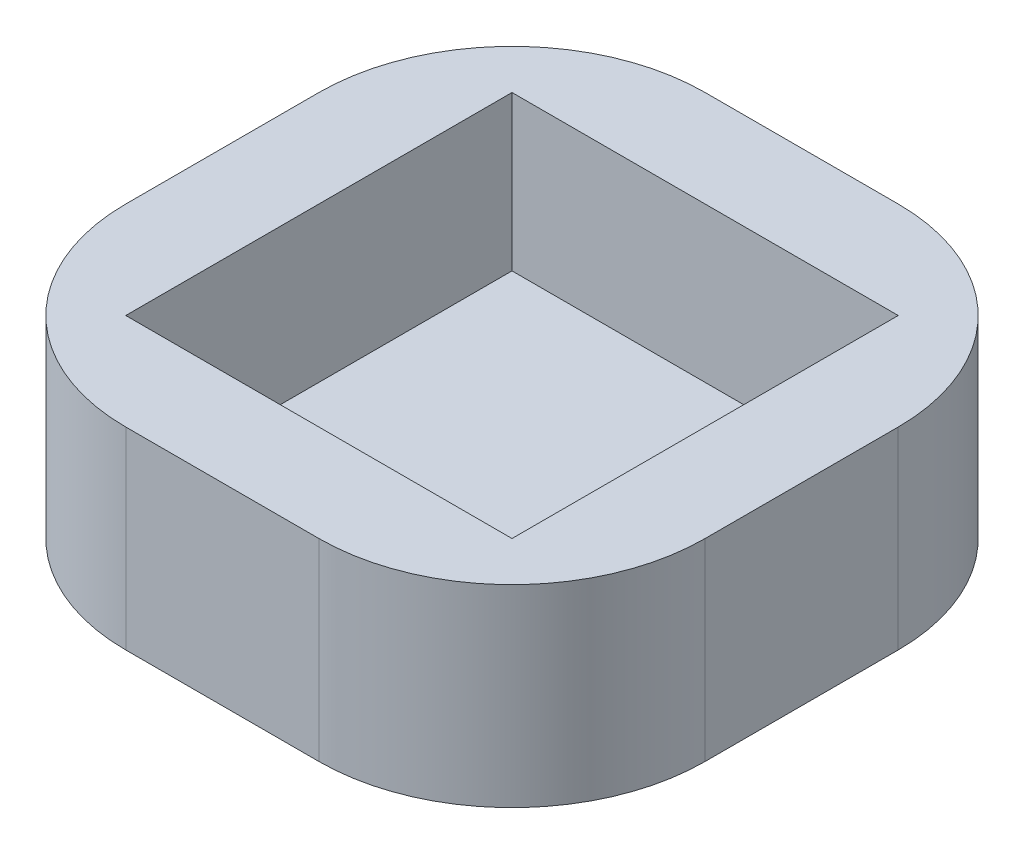
ISO-10303-21;
HEADER;
FILE_DESCRIPTION(('STEP AP214'),'2;1');
FILE_NAME('part.step','',(''),(''),'','','');
FILE_SCHEMA(('AUTOMOTIVE_DESIGN { 1 0 10303 214 1 1 1 1 }'));
ENDSEC;
DATA;
#1=APPLICATION_CONTEXT('core data for automotive mechanical design processes');
#2=APPLICATION_PROTOCOL_DEFINITION('international standard','automotive_design',2000,#1);
#3=PRODUCT_CONTEXT('',#1,'mechanical');
#4=PRODUCT('Part','Part','',(#3));
#5=PRODUCT_RELATED_PRODUCT_CATEGORY('part','',(#4));
#6=PRODUCT_DEFINITION_FORMATION('','',#4);
#7=PRODUCT_DEFINITION_CONTEXT('part definition',#1,'design');
#8=PRODUCT_DEFINITION('design','',#6,#7);
#9=PRODUCT_DEFINITION_SHAPE('','',#8);
#10=(LENGTH_UNIT() NAMED_UNIT(*) SI_UNIT(.MILLI.,.METRE.));
#11=(NAMED_UNIT(*) PLANE_ANGLE_UNIT() SI_UNIT($,.RADIAN.));
#12=(NAMED_UNIT(*) SI_UNIT($,.STERADIAN.) SOLID_ANGLE_UNIT());
#13=UNCERTAINTY_MEASURE_WITH_UNIT(LENGTH_MEASURE(1.E-05),#10,'distance_accuracy_value','');
#14=(GEOMETRIC_REPRESENTATION_CONTEXT(3) GLOBAL_UNCERTAINTY_ASSIGNED_CONTEXT((#13)) GLOBAL_UNIT_ASSIGNED_CONTEXT((#10,
#11,#12)) REPRESENTATION_CONTEXT('',''));
#15=CARTESIAN_POINT('',(0.,0.,0.));
#16=DIRECTION('',(0.,0.,1.));
#17=DIRECTION('',(1.,0.,0.));
#18=AXIS2_PLACEMENT_3D('',#15,#16,#17);
#19=CARTESIAN_POINT('',(-26.3921045150164,10.,10.6494234146817));
#20=DIRECTION('',(0.,-1.,0.));
#21=DIRECTION('',(0.,0.,-1.));
#22=AXIS2_PLACEMENT_3D('',#19,#20,#21);
#23=CYLINDRICAL_SURFACE('',#22,10.);
#24=CARTESIAN_POINT('',(-26.3921045150164,0.,10.6494234146817));
#25=DIRECTION('',(0.,1.,0.));
#26=DIRECTION('',(0.,0.,1.));
#27=AXIS2_PLACEMENT_3D('',#24,#25,#26);
#28=CIRCLE('',#27,10.);
#29=CARTESIAN_POINT('',(-36.3921045150164,0.,10.6494234146816));
#30=VERTEX_POINT('',#29);
#31=CARTESIAN_POINT('',(-26.3921045150163,0.,20.6494234146817));
#32=VERTEX_POINT('',#31);
#33=EDGE_CURVE('E141',#30,#32,#28,.T.);
#34=ORIENTED_EDGE('',*,*,#33,.T.);
#35=DIRECTION('',(0.,-1.,0.));
#36=VECTOR('',#35,1.);
#37=CARTESIAN_POINT('',(-26.3921045150163,10.,20.6494234146817));
#38=LINE('',#37,#36);
#39=CARTESIAN_POINT('',(-26.3921045150163,10.,20.6494234146817));
#40=VERTEX_POINT('',#39);
#41=EDGE_CURVE('E11',#40,#32,#38,.T.);
#42=ORIENTED_EDGE('',*,*,#41,.F.);
#43=CARTESIAN_POINT('',(-26.3921045150164,10.,10.6494234146817));
#44=DIRECTION('',(0.,1.,0.));
#45=DIRECTION('',(0.,0.,1.));
#46=AXIS2_PLACEMENT_3D('',#43,#44,#45);
#47=CIRCLE('',#46,10.);
#48=CARTESIAN_POINT('',(-36.3921045150164,10.,10.6494234146816));
#49=VERTEX_POINT('',#48);
#50=EDGE_CURVE('E157',#49,#40,#47,.T.);
#51=ORIENTED_EDGE('',*,*,#50,.F.);
#52=DIRECTION('',(0.,-1.,0.));
#53=VECTOR('',#52,1.);
#54=CARTESIAN_POINT('',(-36.3921045150164,10.,10.6494234146816));
#55=LINE('',#54,#53);
#56=EDGE_CURVE('E137',#49,#30,#55,.T.);
#57=ORIENTED_EDGE('',*,*,#56,.T.);
#58=EDGE_LOOP('',(#34,#42,#51,#57));
#59=FACE_BOUND('',#58,.T.);
#60=ADVANCED_FACE('F33',(#59),#23,.T.);
#61=CARTESIAN_POINT('',(-26.3921045150163,10.,20.6494234146817));
#62=DIRECTION('',(0.,0.,-1.));
#63=DIRECTION('',(-1.,0.,0.));
#64=AXIS2_PLACEMENT_3D('',#61,#62,#63);
#65=PLANE('',#64);
#66=DIRECTION('',(1.,0.,0.));
#67=VECTOR('',#66,1.);
#68=CARTESIAN_POINT('',(-26.3921045150163,0.,20.6494234146817));
#69=LINE('',#68,#67);
#70=CARTESIAN_POINT('',(-16.3921045150164,0.,20.6494234146817));
#71=VERTEX_POINT('',#70);
#72=EDGE_CURVE('E144',#32,#71,#69,.T.);
#73=ORIENTED_EDGE('',*,*,#72,.T.);
#74=DIRECTION('',(0.,-1.,0.));
#75=VECTOR('',#74,1.);
#76=CARTESIAN_POINT('',(-16.3921045150164,10.,20.6494234146817));
#77=LINE('',#76,#75);
#78=CARTESIAN_POINT('',(-16.3921045150164,10.,20.6494234146817));
#79=VERTEX_POINT('',#78);
#80=EDGE_CURVE('E40',#79,#71,#77,.T.);
#81=ORIENTED_EDGE('',*,*,#80,.F.);
#82=DIRECTION('',(1.,0.,0.));
#83=VECTOR('',#82,1.);
#84=CARTESIAN_POINT('',(-26.3921045150163,10.,20.6494234146817));
#85=LINE('',#84,#83);
#86=EDGE_CURVE('E97',#40,#79,#85,.T.);
#87=ORIENTED_EDGE('',*,*,#86,.F.);
#88=ORIENTED_EDGE('',*,*,#41,.T.);
#89=EDGE_LOOP('',(#73,#81,#87,#88));
#90=FACE_BOUND('',#89,.T.);
#91=ADVANCED_FACE('F260',(#90),#65,.F.);
#92=CARTESIAN_POINT('',(-16.3921045150164,10.,10.6494234146817));
#93=DIRECTION('',(0.,-1.,0.));
#94=DIRECTION('',(0.,0.,-1.));
#95=AXIS2_PLACEMENT_3D('',#92,#93,#94);
#96=CYLINDRICAL_SURFACE('',#95,10.);
#97=CARTESIAN_POINT('',(-16.3921045150164,0.,10.6494234146817));
#98=DIRECTION('',(0.,1.,0.));
#99=DIRECTION('',(0.,0.,1.));
#100=AXIS2_PLACEMENT_3D('',#97,#98,#99);
#101=CIRCLE('',#100,10.);
#102=CARTESIAN_POINT('',(-6.3921045150164,0.,10.6494234146817));
#103=VERTEX_POINT('',#102);
#104=EDGE_CURVE('E147',#71,#103,#101,.T.);
#105=ORIENTED_EDGE('',*,*,#104,.T.);
#106=DIRECTION('',(0.,-1.,0.));
#107=VECTOR('',#106,1.);
#108=CARTESIAN_POINT('',(-6.3921045150164,10.,10.6494234146817));
#109=LINE('',#108,#107);
#110=CARTESIAN_POINT('',(-6.3921045150164,10.,10.6494234146817));
#111=VERTEX_POINT('',#110);
#112=EDGE_CURVE('E164',#111,#103,#109,.T.);
#113=ORIENTED_EDGE('',*,*,#112,.F.);
#114=CARTESIAN_POINT('',(-16.3921045150164,10.,10.6494234146817));
#115=DIRECTION('',(0.,1.,0.));
#116=DIRECTION('',(0.,0.,1.));
#117=AXIS2_PLACEMENT_3D('',#114,#115,#116);
#118=CIRCLE('',#117,10.);
#119=EDGE_CURVE('E172',#79,#111,#118,.T.);
#120=ORIENTED_EDGE('',*,*,#119,.F.);
#121=ORIENTED_EDGE('',*,*,#80,.T.);
#122=EDGE_LOOP('',(#105,#113,#120,#121));
#123=FACE_BOUND('',#122,.T.);
#124=ADVANCED_FACE('F170',(#123),#96,.T.);
#125=CARTESIAN_POINT('',(-6.3921045150164,10.,0.649423414681678));
#126=DIRECTION('',(-1.,0.,0.));
#127=DIRECTION('',(0.,0.,1.));
#128=AXIS2_PLACEMENT_3D('',#125,#126,#127);
#129=PLANE('',#128);
#130=DIRECTION('',(0.,0.,-1.));
#131=VECTOR('',#130,1.);
#132=CARTESIAN_POINT('',(-6.3921045150164,0.,0.649423414681678));
#133=LINE('',#132,#131);
#134=CARTESIAN_POINT('',(-6.3921045150164,0.,0.649423414681679));
#135=VERTEX_POINT('',#134);
#136=EDGE_CURVE('E149',#103,#135,#133,.T.);
#137=ORIENTED_EDGE('',*,*,#136,.T.);
#138=DIRECTION('',(0.,-1.,0.));
#139=VECTOR('',#138,1.);
#140=CARTESIAN_POINT('',(-6.3921045150164,10.,0.649423414681679));
#141=LINE('',#140,#139);
#142=CARTESIAN_POINT('',(-6.3921045150164,10.,0.649423414681679));
#143=VERTEX_POINT('',#142);
#144=EDGE_CURVE('E161',#143,#135,#141,.T.);
#145=ORIENTED_EDGE('',*,*,#144,.F.);
#146=DIRECTION('',(0.,0.,-1.));
#147=VECTOR('',#146,1.);
#148=CARTESIAN_POINT('',(-6.3921045150164,10.,0.649423414681678));
#149=LINE('',#148,#147);
#150=EDGE_CURVE('E184',#111,#143,#149,.T.);
#151=ORIENTED_EDGE('',*,*,#150,.F.);
#152=ORIENTED_EDGE('',*,*,#112,.T.);
#153=EDGE_LOOP('',(#137,#145,#151,#152));
#154=FACE_BOUND('',#153,.T.);
#155=ADVANCED_FACE('F180',(#154),#129,.F.);
#156=CARTESIAN_POINT('',(-16.3921045150164,10.,0.649423414681679));
#157=DIRECTION('',(0.,-1.,0.));
#158=DIRECTION('',(0.,0.,-1.));
#159=AXIS2_PLACEMENT_3D('',#156,#157,#158);
#160=CYLINDRICAL_SURFACE('',#159,10.);
#161=CARTESIAN_POINT('',(-16.3921045150164,0.,0.649423414681679));
#162=DIRECTION('',(0.,1.,0.));
#163=DIRECTION('',(0.,0.,-1.));
#164=AXIS2_PLACEMENT_3D('',#161,#162,#163);
#165=CIRCLE('',#164,10.);
#166=CARTESIAN_POINT('',(-16.3921045150164,0.,-9.35057658531832));
#167=VERTEX_POINT('',#166);
#168=EDGE_CURVE('E151',#135,#167,#165,.T.);
#169=ORIENTED_EDGE('',*,*,#168,.T.);
#170=DIRECTION('',(0.,-1.,0.));
#171=VECTOR('',#170,1.);
#172=CARTESIAN_POINT('',(-16.3921045150164,10.,-9.35057658531832));
#173=LINE('',#172,#171);
#174=CARTESIAN_POINT('',(-16.3921045150164,10.,-9.35057658531832));
#175=VERTEX_POINT('',#174);
#176=EDGE_CURVE('E132',#175,#167,#173,.T.);
#177=ORIENTED_EDGE('',*,*,#176,.F.);
#178=CARTESIAN_POINT('',(-16.3921045150164,10.,0.649423414681679));
#179=DIRECTION('',(0.,1.,0.));
#180=DIRECTION('',(0.,0.,-1.));
#181=AXIS2_PLACEMENT_3D('',#178,#179,#180);
#182=CIRCLE('',#181,10.);
#183=EDGE_CURVE('E120',#143,#175,#182,.T.);
#184=ORIENTED_EDGE('',*,*,#183,.F.);
#185=ORIENTED_EDGE('',*,*,#144,.T.);
#186=EDGE_LOOP('',(#169,#177,#184,#185));
#187=FACE_BOUND('',#186,.T.);
#188=ADVANCED_FACE('F183',(#187),#160,.T.);
#189=CARTESIAN_POINT('',(-26.3921045150164,10.,-9.35057658531832));
#190=DIRECTION('',(0.,0.,1.));
#191=DIRECTION('',(1.,0.,0.));
#192=AXIS2_PLACEMENT_3D('',#189,#190,#191);
#193=PLANE('',#192);
#194=DIRECTION('',(-1.,0.,0.));
#195=VECTOR('',#194,1.);
#196=CARTESIAN_POINT('',(-26.3921045150164,0.,-9.35057658531832));
#197=LINE('',#196,#195);
#198=CARTESIAN_POINT('',(-26.3921045150164,0.,-9.35057658531832));
#199=VERTEX_POINT('',#198);
#200=EDGE_CURVE('E129',#167,#199,#197,.T.);
#201=ORIENTED_EDGE('',*,*,#200,.T.);
#202=DIRECTION('',(0.,-1.,0.));
#203=VECTOR('',#202,1.);
#204=CARTESIAN_POINT('',(-26.3921045150164,10.,-9.35057658531832));
#205=LINE('',#204,#203);
#206=CARTESIAN_POINT('',(-26.3921045150164,10.,-9.35057658531832));
#207=VERTEX_POINT('',#206);
#208=EDGE_CURVE('E126',#207,#199,#205,.T.);
#209=ORIENTED_EDGE('',*,*,#208,.F.);
#210=DIRECTION('',(-1.,0.,0.));
#211=VECTOR('',#210,1.);
#212=CARTESIAN_POINT('',(-26.3921045150164,10.,-9.35057658531832));
#213=LINE('',#212,#211);
#214=EDGE_CURVE('E113',#175,#207,#213,.T.);
#215=ORIENTED_EDGE('',*,*,#214,.F.);
#216=ORIENTED_EDGE('',*,*,#176,.T.);
#217=EDGE_LOOP('',(#201,#209,#215,#216));
#218=FACE_BOUND('',#217,.T.);
#219=ADVANCED_FACE('F127',(#218),#193,.F.);
#220=CARTESIAN_POINT('',(-26.3921045150164,10.,0.649423414681679));
#221=DIRECTION('',(0.,-1.,0.));
#222=DIRECTION('',(0.,0.,-1.));
#223=AXIS2_PLACEMENT_3D('',#220,#221,#222);
#224=CYLINDRICAL_SURFACE('',#223,10.);
#225=CARTESIAN_POINT('',(-26.3921045150164,0.,0.649423414681679));
#226=DIRECTION('',(0.,1.,0.));
#227=DIRECTION('',(0.,0.,1.));
#228=AXIS2_PLACEMENT_3D('',#225,#226,#227);
#229=CIRCLE('',#228,10.);
#230=CARTESIAN_POINT('',(-36.3921045150164,0.,0.649423414681681));
#231=VERTEX_POINT('',#230);
#232=EDGE_CURVE('E154',#199,#231,#229,.T.);
#233=ORIENTED_EDGE('',*,*,#232,.T.);
#234=DIRECTION('',(0.,-1.,0.));
#235=VECTOR('',#234,1.);
#236=CARTESIAN_POINT('',(-36.3921045150164,10.,0.649423414681681));
#237=LINE('',#236,#235);
#238=CARTESIAN_POINT('',(-36.3921045150164,10.,0.649423414681681));
#239=VERTEX_POINT('',#238);
#240=EDGE_CURVE('E133',#239,#231,#237,.T.);
#241=ORIENTED_EDGE('',*,*,#240,.F.);
#242=CARTESIAN_POINT('',(-26.3921045150164,10.,0.649423414681679));
#243=DIRECTION('',(0.,1.,0.));
#244=DIRECTION('',(0.,0.,1.));
#245=AXIS2_PLACEMENT_3D('',#242,#243,#244);
#246=CIRCLE('',#245,10.);
#247=EDGE_CURVE('E117',#207,#239,#246,.T.);
#248=ORIENTED_EDGE('',*,*,#247,.F.);
#249=ORIENTED_EDGE('',*,*,#208,.T.);
#250=EDGE_LOOP('',(#233,#241,#248,#249));
#251=FACE_BOUND('',#250,.T.);
#252=ADVANCED_FACE('F135',(#251),#224,.T.);
#253=CARTESIAN_POINT('',(-36.3921045150164,10.,0.649423414681681));
#254=DIRECTION('',(1.,0.,0.));
#255=DIRECTION('',(0.,0.,-1.));
#256=AXIS2_PLACEMENT_3D('',#253,#254,#255);
#257=PLANE('',#256);
#258=DIRECTION('',(0.,0.,1.));
#259=VECTOR('',#258,1.);
#260=CARTESIAN_POINT('',(-36.3921045150164,0.,0.649423414681681));
#261=LINE('',#260,#259);
#262=EDGE_CURVE('E89',#231,#30,#261,.T.);
#263=ORIENTED_EDGE('',*,*,#262,.T.);
#264=ORIENTED_EDGE('',*,*,#56,.F.);
#265=DIRECTION('',(0.,0.,1.));
#266=VECTOR('',#265,1.);
#267=CARTESIAN_POINT('',(-36.3921045150164,10.,0.649423414681681));
#268=LINE('',#267,#266);
#269=EDGE_CURVE('E56',#239,#49,#268,.T.);
#270=ORIENTED_EDGE('',*,*,#269,.F.);
#271=ORIENTED_EDGE('',*,*,#240,.T.);
#272=EDGE_LOOP('',(#263,#264,#270,#271));
#273=FACE_BOUND('',#272,.T.);
#274=ADVANCED_FACE('F267',(#273),#257,.F.);
#275=CARTESIAN_POINT('',(-26.3921045150164,10.,10.6494234146817));
#276=DIRECTION('',(0.,1.,0.));
#277=DIRECTION('',(0.,0.,1.));
#278=AXIS2_PLACEMENT_3D('',#275,#276,#277);
#279=PLANE('',#278);
#280=DIRECTION('',(0.,0.,1.));
#281=VECTOR('',#280,1.);
#282=CARTESIAN_POINT('',(-31.3921045150164,10.,-4.35057658531832));
#283=LINE('',#282,#281);
#284=CARTESIAN_POINT('',(-31.3921045150164,10.,-4.35057658531832));
#285=VERTEX_POINT('',#284);
#286=CARTESIAN_POINT('',(-31.3921045150164,10.,15.6494234146817));
#287=VERTEX_POINT('',#286);
#288=EDGE_CURVE('E47',#285,#287,#283,.T.);
#289=ORIENTED_EDGE('',*,*,#288,.F.);
#290=DIRECTION('',(-1.,0.,0.));
#291=VECTOR('',#290,1.);
#292=CARTESIAN_POINT('',(-31.3921045150164,10.,-4.35057658531832));
#293=LINE('',#292,#291);
#294=CARTESIAN_POINT('',(-11.3921045150164,10.,-4.35057658531833));
#295=VERTEX_POINT('',#294);
#296=EDGE_CURVE('E200',#295,#285,#293,.T.);
#297=ORIENTED_EDGE('',*,*,#296,.F.);
#298=DIRECTION('',(0.,0.,-1.));
#299=VECTOR('',#298,1.);
#300=CARTESIAN_POINT('',(-11.3921045150164,10.,-4.35057658531833));
#301=LINE('',#300,#299);
#302=CARTESIAN_POINT('',(-11.3921045150164,10.,15.6494234146817));
#303=VERTEX_POINT('',#302);
#304=EDGE_CURVE('E204',#303,#295,#301,.T.);
#305=ORIENTED_EDGE('',*,*,#304,.F.);
#306=DIRECTION('',(1.,0.,0.));
#307=VECTOR('',#306,1.);
#308=CARTESIAN_POINT('',(-31.3921045150164,10.,15.6494234146817));
#309=LINE('',#308,#307);
#310=EDGE_CURVE('E207',#287,#303,#309,.T.);
#311=ORIENTED_EDGE('',*,*,#310,.F.);
#312=EDGE_LOOP('',(#289,#297,#305,#311));
#313=FACE_BOUND('',#312,.T.);
#314=ORIENTED_EDGE('',*,*,#50,.T.);
#315=ORIENTED_EDGE('',*,*,#86,.T.);
#316=ORIENTED_EDGE('',*,*,#119,.T.);
#317=ORIENTED_EDGE('',*,*,#150,.T.);
#318=ORIENTED_EDGE('',*,*,#183,.T.);
#319=ORIENTED_EDGE('',*,*,#214,.T.);
#320=ORIENTED_EDGE('',*,*,#247,.T.);
#321=ORIENTED_EDGE('',*,*,#269,.T.);
#322=EDGE_LOOP('',(#314,#315,#316,#317,#318,#319,#320,#321));
#323=FACE_BOUND('',#322,.T.);
#324=ADVANCED_FACE('F115',(#313,#323),#279,.T.);
#325=CARTESIAN_POINT('',(-26.3921045150164,0.,10.6494234146817));
#326=DIRECTION('',(0.,1.,0.));
#327=DIRECTION('',(0.,0.,1.));
#328=AXIS2_PLACEMENT_3D('',#325,#326,#327);
#329=PLANE('',#328);
#330=ORIENTED_EDGE('',*,*,#33,.F.);
#331=ORIENTED_EDGE('',*,*,#262,.F.);
#332=ORIENTED_EDGE('',*,*,#232,.F.);
#333=ORIENTED_EDGE('',*,*,#200,.F.);
#334=ORIENTED_EDGE('',*,*,#168,.F.);
#335=ORIENTED_EDGE('',*,*,#136,.F.);
#336=ORIENTED_EDGE('',*,*,#104,.F.);
#337=ORIENTED_EDGE('',*,*,#72,.F.);
#338=EDGE_LOOP('',(#330,#331,#332,#333,#334,#335,#336,#337));
#339=FACE_BOUND('',#338,.T.);
#340=ADVANCED_FACE('F176',(#339),#329,.F.);
#341=CARTESIAN_POINT('',(-31.3921045150164,2.,-4.35057658531832));
#342=DIRECTION('',(-1.,0.,0.));
#343=DIRECTION('',(0.,0.,1.));
#344=AXIS2_PLACEMENT_3D('',#341,#342,#343);
#345=PLANE('',#344);
#346=ORIENTED_EDGE('',*,*,#288,.T.);
#347=DIRECTION('',(0.,1.,0.));
#348=VECTOR('',#347,1.);
#349=CARTESIAN_POINT('',(-31.3921045150164,2.,15.6494234146817));
#350=LINE('',#349,#348);
#351=CARTESIAN_POINT('',(-31.3921045150164,2.,15.6494234146817));
#352=VERTEX_POINT('',#351);
#353=EDGE_CURVE('E190',#352,#287,#350,.T.);
#354=ORIENTED_EDGE('',*,*,#353,.F.);
#355=DIRECTION('',(0.,0.,1.));
#356=VECTOR('',#355,1.);
#357=CARTESIAN_POINT('',(-31.3921045150164,2.,-4.35057658531832));
#358=LINE('',#357,#356);
#359=CARTESIAN_POINT('',(-31.3921045150164,2.,-4.35057658531832));
#360=VERTEX_POINT('',#359);
#361=EDGE_CURVE('E203',#360,#352,#358,.T.);
#362=ORIENTED_EDGE('',*,*,#361,.F.);
#363=DIRECTION('',(0.,1.,0.));
#364=VECTOR('',#363,1.);
#365=CARTESIAN_POINT('',(-31.3921045150164,2.,-4.35057658531832));
#366=LINE('',#365,#364);
#367=EDGE_CURVE('E145',#360,#285,#366,.T.);
#368=ORIENTED_EDGE('',*,*,#367,.T.);
#369=EDGE_LOOP('',(#346,#354,#362,#368));
#370=FACE_BOUND('',#369,.T.);
#371=ADVANCED_FACE('F228',(#370),#345,.F.);
#372=CARTESIAN_POINT('',(-31.3921045150164,2.,-4.35057658531832));
#373=DIRECTION('',(0.,0.,-1.));
#374=DIRECTION('',(-1.,0.,0.));
#375=AXIS2_PLACEMENT_3D('',#372,#373,#374);
#376=PLANE('',#375);
#377=ORIENTED_EDGE('',*,*,#296,.T.);
#378=ORIENTED_EDGE('',*,*,#367,.F.);
#379=DIRECTION('',(-1.,0.,0.));
#380=VECTOR('',#379,1.);
#381=CARTESIAN_POINT('',(-31.3921045150164,2.,-4.35057658531832));
#382=LINE('',#381,#380);
#383=CARTESIAN_POINT('',(-11.3921045150164,2.,-4.35057658531833));
#384=VERTEX_POINT('',#383);
#385=EDGE_CURVE('E193',#384,#360,#382,.T.);
#386=ORIENTED_EDGE('',*,*,#385,.F.);
#387=DIRECTION('',(0.,1.,0.));
#388=VECTOR('',#387,1.);
#389=CARTESIAN_POINT('',(-11.3921045150164,2.,-4.35057658531833));
#390=LINE('',#389,#388);
#391=EDGE_CURVE('E196',#384,#295,#390,.T.);
#392=ORIENTED_EDGE('',*,*,#391,.T.);
#393=EDGE_LOOP('',(#377,#378,#386,#392));
#394=FACE_BOUND('',#393,.T.);
#395=ADVANCED_FACE('F239',(#394),#376,.F.);
#396=CARTESIAN_POINT('',(-11.3921045150164,2.,-4.35057658531833));
#397=DIRECTION('',(1.,0.,0.));
#398=DIRECTION('',(0.,0.,-1.));
#399=AXIS2_PLACEMENT_3D('',#396,#397,#398);
#400=PLANE('',#399);
#401=ORIENTED_EDGE('',*,*,#304,.T.);
#402=ORIENTED_EDGE('',*,*,#391,.F.);
#403=DIRECTION('',(0.,0.,-1.));
#404=VECTOR('',#403,1.);
#405=CARTESIAN_POINT('',(-11.3921045150164,2.,-4.35057658531833));
#406=LINE('',#405,#404);
#407=CARTESIAN_POINT('',(-11.3921045150164,2.,15.6494234146817));
#408=VERTEX_POINT('',#407);
#409=EDGE_CURVE('E213',#408,#384,#406,.T.);
#410=ORIENTED_EDGE('',*,*,#409,.F.);
#411=DIRECTION('',(0.,1.,0.));
#412=VECTOR('',#411,1.);
#413=CARTESIAN_POINT('',(-11.3921045150164,2.,15.6494234146817));
#414=LINE('',#413,#412);
#415=EDGE_CURVE('E192',#408,#303,#414,.T.);
#416=ORIENTED_EDGE('',*,*,#415,.T.);
#417=EDGE_LOOP('',(#401,#402,#410,#416));
#418=FACE_BOUND('',#417,.T.);
#419=ADVANCED_FACE('F244',(#418),#400,.F.);
#420=CARTESIAN_POINT('',(-31.3921045150164,2.,15.6494234146817));
#421=DIRECTION('',(0.,0.,1.));
#422=DIRECTION('',(1.,0.,0.));
#423=AXIS2_PLACEMENT_3D('',#420,#421,#422);
#424=PLANE('',#423);
#425=ORIENTED_EDGE('',*,*,#310,.T.);
#426=ORIENTED_EDGE('',*,*,#415,.F.);
#427=DIRECTION('',(1.,0.,0.));
#428=VECTOR('',#427,1.);
#429=CARTESIAN_POINT('',(-31.3921045150164,2.,15.6494234146817));
#430=LINE('',#429,#428);
#431=EDGE_CURVE('E216',#352,#408,#430,.T.);
#432=ORIENTED_EDGE('',*,*,#431,.F.);
#433=ORIENTED_EDGE('',*,*,#353,.T.);
#434=EDGE_LOOP('',(#425,#426,#432,#433));
#435=FACE_BOUND('',#434,.T.);
#436=ADVANCED_FACE('F249',(#435),#424,.F.);
#437=CARTESIAN_POINT('',(-31.3921045150164,2.,15.6494234146817));
#438=DIRECTION('',(0.,1.,0.));
#439=DIRECTION('',(0.,0.,1.));
#440=AXIS2_PLACEMENT_3D('',#437,#438,#439);
#441=PLANE('',#440);
#442=ORIENTED_EDGE('',*,*,#361,.T.);
#443=ORIENTED_EDGE('',*,*,#431,.T.);
#444=ORIENTED_EDGE('',*,*,#409,.T.);
#445=ORIENTED_EDGE('',*,*,#385,.T.);
#446=EDGE_LOOP('',(#442,#443,#444,#445));
#447=FACE_BOUND('',#446,.T.);
#448=ADVANCED_FACE('F223',(#447),#441,.T.);
#449=CLOSED_SHELL('',(#60,#91,#124,#155,#188,#219,#252,#274,#324,#340,#371,#395,#419,#436,#448));
#450=MANIFOLD_SOLID_BREP('B2',#449);
#451=ADVANCED_BREP_SHAPE_REPRESENTATION('',(#18,#450),#14);
#452=SHAPE_DEFINITION_REPRESENTATION(#9,#451);
ENDSEC;
END-ISO-10303-21;
